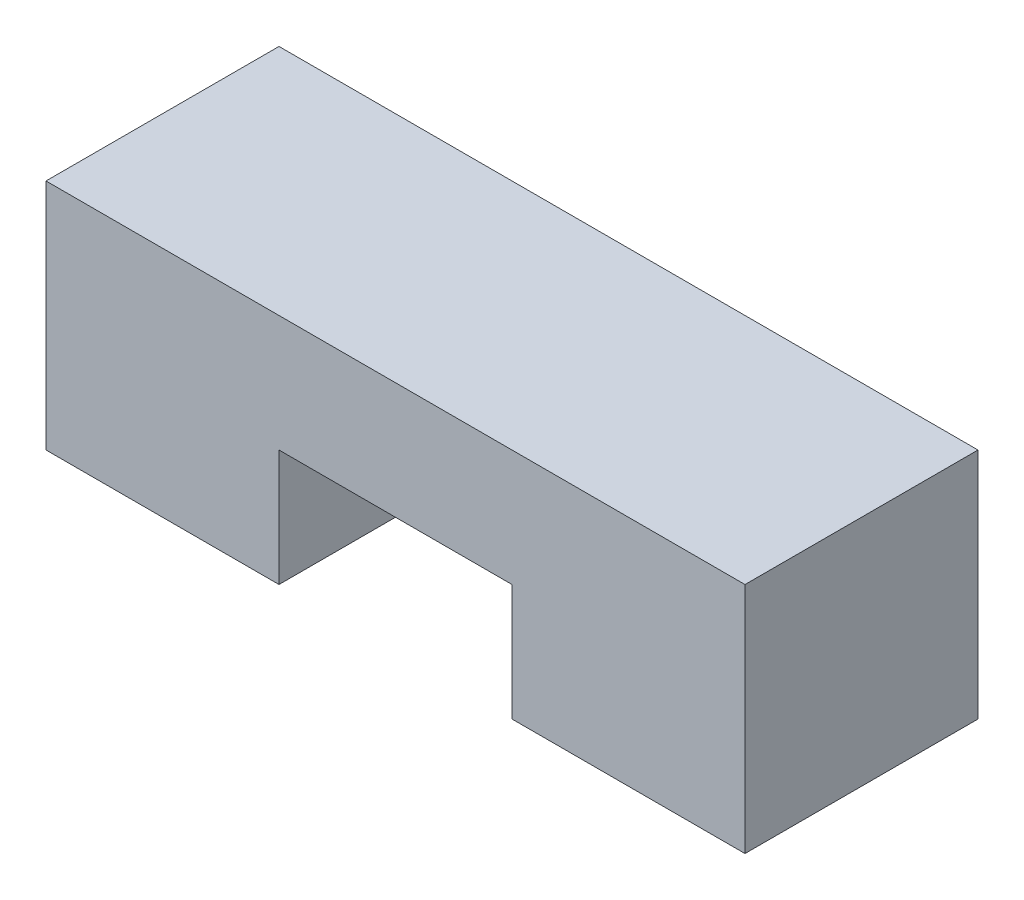
ISO-10303-21;
HEADER;
FILE_DESCRIPTION(('STEP AP214'),'2;1');
FILE_NAME('part.step','',(''),(''),'','','');
FILE_SCHEMA(('AUTOMOTIVE_DESIGN { 1 0 10303 214 1 1 1 1 }'));
ENDSEC;
DATA;
#1=APPLICATION_CONTEXT('core data for automotive mechanical design processes');
#2=APPLICATION_PROTOCOL_DEFINITION('international standard','automotive_design',2000,#1);
#3=PRODUCT_CONTEXT('',#1,'mechanical');
#4=PRODUCT('Part','Part','',(#3));
#5=PRODUCT_RELATED_PRODUCT_CATEGORY('part','',(#4));
#6=PRODUCT_DEFINITION_FORMATION('','',#4);
#7=PRODUCT_DEFINITION_CONTEXT('part definition',#1,'design');
#8=PRODUCT_DEFINITION('design','',#6,#7);
#9=PRODUCT_DEFINITION_SHAPE('','',#8);
#10=(LENGTH_UNIT() NAMED_UNIT(*) SI_UNIT(.MILLI.,.METRE.));
#11=(NAMED_UNIT(*) PLANE_ANGLE_UNIT() SI_UNIT($,.RADIAN.));
#12=(NAMED_UNIT(*) SI_UNIT($,.STERADIAN.) SOLID_ANGLE_UNIT());
#13=UNCERTAINTY_MEASURE_WITH_UNIT(LENGTH_MEASURE(1.E-05),#10,'distance_accuracy_value','');
#14=(GEOMETRIC_REPRESENTATION_CONTEXT(3) GLOBAL_UNCERTAINTY_ASSIGNED_CONTEXT((#13)) GLOBAL_UNIT_ASSIGNED_CONTEXT((#10,
#11,#12)) REPRESENTATION_CONTEXT('',''));
#15=CARTESIAN_POINT('',(0.,0.,0.));
#16=DIRECTION('',(0.,0.,1.));
#17=DIRECTION('',(1.,0.,0.));
#18=AXIS2_PLACEMENT_3D('',#15,#16,#17);
#19=CARTESIAN_POINT('',(0.,0.,-25.4));
#20=DIRECTION('',(-1.,0.,0.));
#21=DIRECTION('',(0.,0.,1.));
#22=AXIS2_PLACEMENT_3D('',#19,#20,#21);
#23=PLANE('',#22);
#24=DIRECTION('',(0.,-1.,0.));
#25=VECTOR('',#24,1.);
#26=CARTESIAN_POINT('',(0.,0.,0.));
#27=LINE('',#26,#25);
#28=CARTESIAN_POINT('',(0.,25.4,0.));
#29=VERTEX_POINT('',#28);
#30=CARTESIAN_POINT('',(0.,0.,0.));
#31=VERTEX_POINT('',#30);
#32=EDGE_CURVE('E142',#29,#31,#27,.T.);
#33=ORIENTED_EDGE('',*,*,#32,.F.);
#34=DIRECTION('',(0.,0.,1.));
#35=VECTOR('',#34,1.);
#36=CARTESIAN_POINT('',(0.,25.4,-25.4));
#37=LINE('',#36,#35);
#38=CARTESIAN_POINT('',(0.,25.4,-25.4));
#39=VERTEX_POINT('',#38);
#40=EDGE_CURVE('E11',#39,#29,#37,.T.);
#41=ORIENTED_EDGE('',*,*,#40,.F.);
#42=DIRECTION('',(0.,-1.,0.));
#43=VECTOR('',#42,1.);
#44=CARTESIAN_POINT('',(0.,0.,-25.4));
#45=LINE('',#44,#43);
#46=CARTESIAN_POINT('',(0.,0.,-25.4));
#47=VERTEX_POINT('',#46);
#48=EDGE_CURVE('E170',#39,#47,#45,.T.);
#49=ORIENTED_EDGE('',*,*,#48,.T.);
#50=DIRECTION('',(0.,0.,1.));
#51=VECTOR('',#50,1.);
#52=CARTESIAN_POINT('',(0.,0.,-25.4));
#53=LINE('',#52,#51);
#54=EDGE_CURVE('E42',#47,#31,#53,.T.);
#55=ORIENTED_EDGE('',*,*,#54,.T.);
#56=EDGE_LOOP('',(#33,#41,#49,#55));
#57=FACE_BOUND('',#56,.T.);
#58=ADVANCED_FACE('F39',(#57),#23,.T.);
#59=CARTESIAN_POINT('',(0.,25.4,-25.4));
#60=DIRECTION('',(0.,1.,0.));
#61=DIRECTION('',(0.,0.,1.));
#62=AXIS2_PLACEMENT_3D('',#59,#60,#61);
#63=PLANE('',#62);
#64=DIRECTION('',(-1.,0.,0.));
#65=VECTOR('',#64,1.);
#66=CARTESIAN_POINT('',(0.,25.4,0.));
#67=LINE('',#66,#65);
#68=CARTESIAN_POINT('',(76.2,25.4,0.));
#69=VERTEX_POINT('',#68);
#70=EDGE_CURVE('E167',#69,#29,#67,.T.);
#71=ORIENTED_EDGE('',*,*,#70,.F.);
#72=DIRECTION('',(0.,0.,1.));
#73=VECTOR('',#72,1.);
#74=CARTESIAN_POINT('',(76.2,25.4,-25.4));
#75=LINE('',#74,#73);
#76=CARTESIAN_POINT('',(76.2,25.4,-25.4));
#77=VERTEX_POINT('',#76);
#78=EDGE_CURVE('E49',#77,#69,#75,.T.);
#79=ORIENTED_EDGE('',*,*,#78,.F.);
#80=DIRECTION('',(-1.,0.,0.));
#81=VECTOR('',#80,1.);
#82=CARTESIAN_POINT('',(0.,25.4,-25.4));
#83=LINE('',#82,#81);
#84=EDGE_CURVE('E128',#77,#39,#83,.T.);
#85=ORIENTED_EDGE('',*,*,#84,.T.);
#86=ORIENTED_EDGE('',*,*,#40,.T.);
#87=EDGE_LOOP('',(#71,#79,#85,#86));
#88=FACE_BOUND('',#87,.T.);
#89=ADVANCED_FACE('F188',(#88),#63,.T.);
#90=CARTESIAN_POINT('',(76.2,0.,-25.4));
#91=DIRECTION('',(1.,0.,0.));
#92=DIRECTION('',(0.,0.,-1.));
#93=AXIS2_PLACEMENT_3D('',#90,#91,#92);
#94=PLANE('',#93);
#95=DIRECTION('',(0.,1.,0.));
#96=VECTOR('',#95,1.);
#97=CARTESIAN_POINT('',(76.2,0.,0.));
#98=LINE('',#97,#96);
#99=CARTESIAN_POINT('',(76.2,0.,0.));
#100=VERTEX_POINT('',#99);
#101=EDGE_CURVE('E114',#100,#69,#98,.T.);
#102=ORIENTED_EDGE('',*,*,#101,.F.);
#103=DIRECTION('',(0.,0.,1.));
#104=VECTOR('',#103,1.);
#105=CARTESIAN_POINT('',(76.2,0.,-25.4));
#106=LINE('',#105,#104);
#107=CARTESIAN_POINT('',(76.2,0.,-25.4));
#108=VERTEX_POINT('',#107);
#109=EDGE_CURVE('E109',#108,#100,#106,.T.);
#110=ORIENTED_EDGE('',*,*,#109,.F.);
#111=DIRECTION('',(0.,1.,0.));
#112=VECTOR('',#111,1.);
#113=CARTESIAN_POINT('',(76.2,0.,-25.4));
#114=LINE('',#113,#112);
#115=EDGE_CURVE('E112',#108,#77,#114,.T.);
#116=ORIENTED_EDGE('',*,*,#115,.T.);
#117=ORIENTED_EDGE('',*,*,#78,.T.);
#118=EDGE_LOOP('',(#102,#110,#116,#117));
#119=FACE_BOUND('',#118,.T.);
#120=ADVANCED_FACE('F111',(#119),#94,.T.);
#121=CARTESIAN_POINT('',(50.8,0.,-25.4));
#122=DIRECTION('',(0.,-1.,0.));
#123=DIRECTION('',(0.,0.,-1.));
#124=AXIS2_PLACEMENT_3D('',#121,#122,#123);
#125=PLANE('',#124);
#126=DIRECTION('',(1.,0.,0.));
#127=VECTOR('',#126,1.);
#128=CARTESIAN_POINT('',(50.8,0.,0.));
#129=LINE('',#128,#127);
#130=CARTESIAN_POINT('',(50.8,0.,0.));
#131=VERTEX_POINT('',#130);
#132=EDGE_CURVE('E162',#131,#100,#129,.T.);
#133=ORIENTED_EDGE('',*,*,#132,.F.);
#134=DIRECTION('',(0.,0.,1.));
#135=VECTOR('',#134,1.);
#136=CARTESIAN_POINT('',(50.8,0.,-25.4));
#137=LINE('',#136,#135);
#138=CARTESIAN_POINT('',(50.8,0.,-25.4));
#139=VERTEX_POINT('',#138);
#140=EDGE_CURVE('E120',#139,#131,#137,.T.);
#141=ORIENTED_EDGE('',*,*,#140,.F.);
#142=DIRECTION('',(1.,0.,0.));
#143=VECTOR('',#142,1.);
#144=CARTESIAN_POINT('',(50.8,0.,-25.4));
#145=LINE('',#144,#143);
#146=EDGE_CURVE('E126',#139,#108,#145,.T.);
#147=ORIENTED_EDGE('',*,*,#146,.T.);
#148=ORIENTED_EDGE('',*,*,#109,.T.);
#149=EDGE_LOOP('',(#133,#141,#147,#148));
#150=FACE_BOUND('',#149,.T.);
#151=ADVANCED_FACE('F131',(#150),#125,.T.);
#152=CARTESIAN_POINT('',(50.8,12.7,-25.4));
#153=DIRECTION('',(-1.,0.,0.));
#154=DIRECTION('',(0.,0.,1.));
#155=AXIS2_PLACEMENT_3D('',#152,#153,#154);
#156=PLANE('',#155);
#157=DIRECTION('',(0.,-1.,0.));
#158=VECTOR('',#157,1.);
#159=CARTESIAN_POINT('',(50.8,12.7,0.));
#160=LINE('',#159,#158);
#161=CARTESIAN_POINT('',(50.8,12.7,0.));
#162=VERTEX_POINT('',#161);
#163=EDGE_CURVE('E158',#162,#131,#160,.T.);
#164=ORIENTED_EDGE('',*,*,#163,.F.);
#165=DIRECTION('',(0.,0.,1.));
#166=VECTOR('',#165,1.);
#167=CARTESIAN_POINT('',(50.8,12.7,-25.4));
#168=LINE('',#167,#166);
#169=CARTESIAN_POINT('',(50.8,12.7,-25.4));
#170=VERTEX_POINT('',#169);
#171=EDGE_CURVE('E176',#170,#162,#168,.T.);
#172=ORIENTED_EDGE('',*,*,#171,.F.);
#173=DIRECTION('',(0.,-1.,0.));
#174=VECTOR('',#173,1.);
#175=CARTESIAN_POINT('',(50.8,12.7,-25.4));
#176=LINE('',#175,#174);
#177=EDGE_CURVE('E133',#170,#139,#176,.T.);
#178=ORIENTED_EDGE('',*,*,#177,.T.);
#179=ORIENTED_EDGE('',*,*,#140,.T.);
#180=EDGE_LOOP('',(#164,#172,#178,#179));
#181=FACE_BOUND('',#180,.T.);
#182=ADVANCED_FACE('F201',(#181),#156,.T.);
#183=CARTESIAN_POINT('',(25.4,12.7,-25.4));
#184=DIRECTION('',(0.,-1.,0.));
#185=DIRECTION('',(0.,0.,-1.));
#186=AXIS2_PLACEMENT_3D('',#183,#184,#185);
#187=PLANE('',#186);
#188=DIRECTION('',(1.,0.,0.));
#189=VECTOR('',#188,1.);
#190=CARTESIAN_POINT('',(25.4,12.7,0.));
#191=LINE('',#190,#189);
#192=CARTESIAN_POINT('',(25.4,12.7,0.));
#193=VERTEX_POINT('',#192);
#194=EDGE_CURVE('E154',#193,#162,#191,.T.);
#195=ORIENTED_EDGE('',*,*,#194,.F.);
#196=DIRECTION('',(0.,0.,1.));
#197=VECTOR('',#196,1.);
#198=CARTESIAN_POINT('',(25.4,12.7,-25.4));
#199=LINE('',#198,#197);
#200=CARTESIAN_POINT('',(25.4,12.7,-25.4));
#201=VERTEX_POINT('',#200);
#202=EDGE_CURVE('E179',#201,#193,#199,.T.);
#203=ORIENTED_EDGE('',*,*,#202,.F.);
#204=DIRECTION('',(1.,0.,0.));
#205=VECTOR('',#204,1.);
#206=CARTESIAN_POINT('',(25.4,12.7,-25.4));
#207=LINE('',#206,#205);
#208=EDGE_CURVE('E136',#201,#170,#207,.T.);
#209=ORIENTED_EDGE('',*,*,#208,.T.);
#210=ORIENTED_EDGE('',*,*,#171,.T.);
#211=EDGE_LOOP('',(#195,#203,#209,#210));
#212=FACE_BOUND('',#211,.T.);
#213=ADVANCED_FACE('F204',(#212),#187,.T.);
#214=CARTESIAN_POINT('',(25.4,0.,-25.4));
#215=DIRECTION('',(1.,0.,0.));
#216=DIRECTION('',(0.,0.,-1.));
#217=AXIS2_PLACEMENT_3D('',#214,#215,#216);
#218=PLANE('',#217);
#219=DIRECTION('',(0.,1.,0.));
#220=VECTOR('',#219,1.);
#221=CARTESIAN_POINT('',(25.4,0.,0.));
#222=LINE('',#221,#220);
#223=CARTESIAN_POINT('',(25.4,0.,0.));
#224=VERTEX_POINT('',#223);
#225=EDGE_CURVE('E150',#224,#193,#222,.T.);
#226=ORIENTED_EDGE('',*,*,#225,.F.);
#227=DIRECTION('',(0.,0.,1.));
#228=VECTOR('',#227,1.);
#229=CARTESIAN_POINT('',(25.4,0.,-25.4));
#230=LINE('',#229,#228);
#231=CARTESIAN_POINT('',(25.4,0.,-25.4));
#232=VERTEX_POINT('',#231);
#233=EDGE_CURVE('E181',#232,#224,#230,.T.);
#234=ORIENTED_EDGE('',*,*,#233,.F.);
#235=DIRECTION('',(0.,1.,0.));
#236=VECTOR('',#235,1.);
#237=CARTESIAN_POINT('',(25.4,0.,-25.4));
#238=LINE('',#237,#236);
#239=EDGE_CURVE('E279',#232,#201,#238,.T.);
#240=ORIENTED_EDGE('',*,*,#239,.T.);
#241=ORIENTED_EDGE('',*,*,#202,.T.);
#242=EDGE_LOOP('',(#226,#234,#240,#241));
#243=FACE_BOUND('',#242,.T.);
#244=ADVANCED_FACE('F208',(#243),#218,.T.);
#245=CARTESIAN_POINT('',(0.,0.,-25.4));
#246=DIRECTION('',(0.,-1.,0.));
#247=DIRECTION('',(0.,0.,-1.));
#248=AXIS2_PLACEMENT_3D('',#245,#246,#247);
#249=PLANE('',#248);
#250=DIRECTION('',(1.,0.,0.));
#251=VECTOR('',#250,1.);
#252=CARTESIAN_POINT('',(0.,0.,0.));
#253=LINE('',#252,#251);
#254=EDGE_CURVE('E146',#31,#224,#253,.T.);
#255=ORIENTED_EDGE('',*,*,#254,.F.);
#256=ORIENTED_EDGE('',*,*,#54,.F.);
#257=DIRECTION('',(1.,0.,0.));
#258=VECTOR('',#257,1.);
#259=CARTESIAN_POINT('',(0.,0.,-25.4));
#260=LINE('',#259,#258);
#261=EDGE_CURVE('E282',#47,#232,#260,.T.);
#262=ORIENTED_EDGE('',*,*,#261,.T.);
#263=ORIENTED_EDGE('',*,*,#233,.T.);
#264=EDGE_LOOP('',(#255,#256,#262,#263));
#265=FACE_BOUND('',#264,.T.);
#266=ADVANCED_FACE('F185',(#265),#249,.T.);
#267=CARTESIAN_POINT('',(0.,0.,-25.4));
#268=DIRECTION('',(0.,0.,-1.));
#269=DIRECTION('',(-1.,0.,0.));
#270=AXIS2_PLACEMENT_3D('',#267,#268,#269);
#271=PLANE('',#270);
#272=ORIENTED_EDGE('',*,*,#48,.F.);
#273=ORIENTED_EDGE('',*,*,#84,.F.);
#274=ORIENTED_EDGE('',*,*,#115,.F.);
#275=ORIENTED_EDGE('',*,*,#146,.F.);
#276=ORIENTED_EDGE('',*,*,#177,.F.);
#277=ORIENTED_EDGE('',*,*,#208,.F.);
#278=ORIENTED_EDGE('',*,*,#239,.F.);
#279=ORIENTED_EDGE('',*,*,#261,.F.);
#280=EDGE_LOOP('',(#272,#273,#274,#275,#276,#277,#278,#279));
#281=FACE_BOUND('',#280,.T.);
#282=ADVANCED_FACE('F124',(#281),#271,.T.);
#283=CARTESIAN_POINT('',(0.,0.,0.));
#284=DIRECTION('',(0.,0.,-1.));
#285=DIRECTION('',(-1.,0.,0.));
#286=AXIS2_PLACEMENT_3D('',#283,#284,#285);
#287=PLANE('',#286);
#288=ORIENTED_EDGE('',*,*,#32,.T.);
#289=ORIENTED_EDGE('',*,*,#254,.T.);
#290=ORIENTED_EDGE('',*,*,#225,.T.);
#291=ORIENTED_EDGE('',*,*,#194,.T.);
#292=ORIENTED_EDGE('',*,*,#163,.T.);
#293=ORIENTED_EDGE('',*,*,#132,.T.);
#294=ORIENTED_EDGE('',*,*,#101,.T.);
#295=ORIENTED_EDGE('',*,*,#70,.T.);
#296=EDGE_LOOP('',(#288,#289,#290,#291,#292,#293,#294,#295));
#297=FACE_BOUND('',#296,.T.);
#298=ADVANCED_FACE('F187',(#297),#287,.F.);
#299=CLOSED_SHELL('',(#58,#89,#120,#151,#182,#213,#244,#266,#282,#298));
#300=MANIFOLD_SOLID_BREP('B2',#299);
#301=ADVANCED_BREP_SHAPE_REPRESENTATION('',(#18,#300),#14);
#302=SHAPE_DEFINITION_REPRESENTATION(#9,#301);
ENDSEC;
END-ISO-10303-21;
